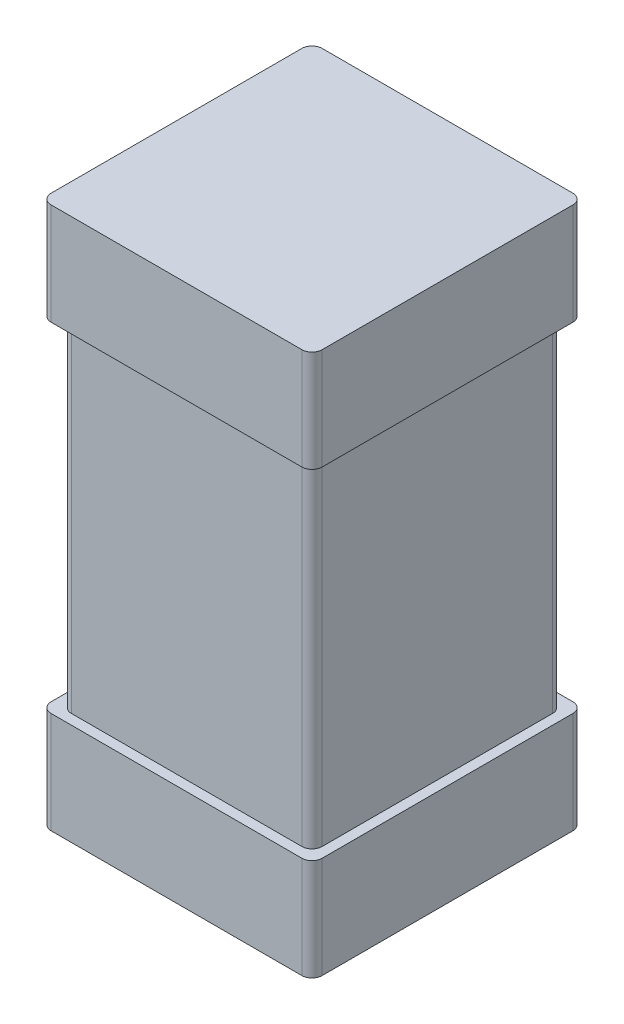
ISO-10303-21;
HEADER;
FILE_DESCRIPTION(('STEP AP214'),'2;1');
FILE_NAME('part.step','',(''),(''),'','','');
FILE_SCHEMA(('AUTOMOTIVE_DESIGN { 1 0 10303 214 1 1 1 1 }'));
ENDSEC;
DATA;
#1=APPLICATION_CONTEXT('core data for automotive mechanical design processes');
#2=APPLICATION_PROTOCOL_DEFINITION('international standard','automotive_design',2000,#1);
#3=PRODUCT_CONTEXT('',#1,'mechanical');
#4=PRODUCT('Part','Part','',(#3));
#5=PRODUCT_RELATED_PRODUCT_CATEGORY('part','',(#4));
#6=PRODUCT_DEFINITION_FORMATION('','',#4);
#7=PRODUCT_DEFINITION_CONTEXT('part definition',#1,'design');
#8=PRODUCT_DEFINITION('design','',#6,#7);
#9=PRODUCT_DEFINITION_SHAPE('','',#8);
#10=(LENGTH_UNIT() NAMED_UNIT(*) SI_UNIT(.MILLI.,.METRE.));
#11=(NAMED_UNIT(*) PLANE_ANGLE_UNIT() SI_UNIT($,.RADIAN.));
#12=(NAMED_UNIT(*) SI_UNIT($,.STERADIAN.) SOLID_ANGLE_UNIT());
#13=UNCERTAINTY_MEASURE_WITH_UNIT(LENGTH_MEASURE(1.E-05),#10,'distance_accuracy_value','');
#14=(GEOMETRIC_REPRESENTATION_CONTEXT(3) GLOBAL_UNCERTAINTY_ASSIGNED_CONTEXT((#13)) GLOBAL_UNIT_ASSIGNED_CONTEXT((#10,
#11,#12)) REPRESENTATION_CONTEXT('',''));
#15=CARTESIAN_POINT('',(0.,0.,0.));
#16=DIRECTION('',(0.,0.,1.));
#17=DIRECTION('',(1.,0.,0.));
#18=AXIS2_PLACEMENT_3D('',#15,#16,#17);
#19=CARTESIAN_POINT('',(129.672744279938,102.69204329235,142.211582908599));
#20=DIRECTION('',(0.,1.,0.));
#21=DIRECTION('',(1.,0.,0.));
#22=AXIS2_PLACEMENT_3D('',#19,#20,#21);
#23=PLANE('',#22);
#24=DIRECTION('',(0.,0.,1.));
#25=VECTOR('',#24,1.);
#26=CARTESIAN_POINT('',(129.672744279938,102.69204329235,142.211582908599));
#27=LINE('',#26,#25);
#28=CARTESIAN_POINT('',(129.672744279938,102.69204329235,142.241582908599));
#29=VERTEX_POINT('',#28);
#30=CARTESIAN_POINT('',(129.672744279938,102.69204329235,142.981582908599));
#31=VERTEX_POINT('',#30);
#32=EDGE_CURVE('E67',#29,#31,#27,.T.);
#33=ORIENTED_EDGE('',*,*,#32,.F.);
#34=CARTESIAN_POINT('',(129.642744279938,102.69204329235,142.241582908599));
#35=DIRECTION('',(0.,1.,0.));
#36=DIRECTION('',(0.,0.,1.));
#37=AXIS2_PLACEMENT_3D('',#34,#35,#36);
#38=CIRCLE('',#37,0.0300000000000023);
#39=CARTESIAN_POINT('',(129.642744279938,102.69204329235,142.211582908599));
#40=VERTEX_POINT('',#39);
#41=EDGE_CURVE('E11',#29,#40,#38,.T.);
#42=ORIENTED_EDGE('',*,*,#41,.T.);
#43=DIRECTION('',(-1.,0.,0.));
#44=VECTOR('',#43,1.);
#45=CARTESIAN_POINT('',(129.672744279938,102.69204329235,142.211582908599));
#46=LINE('',#45,#44);
#47=CARTESIAN_POINT('',(128.902744279938,102.69204329235,142.211582908599));
#48=VERTEX_POINT('',#47);
#49=EDGE_CURVE('E55',#40,#48,#46,.T.);
#50=ORIENTED_EDGE('',*,*,#49,.T.);
#51=CARTESIAN_POINT('',(128.902744279938,102.69204329235,142.241582908599));
#52=DIRECTION('',(0.,-1.,0.));
#53=DIRECTION('',(0.,0.,1.));
#54=AXIS2_PLACEMENT_3D('',#51,#52,#53);
#55=CIRCLE('',#54,0.0300000000000023);
#56=CARTESIAN_POINT('',(128.872744279938,102.69204329235,142.241582908599));
#57=VERTEX_POINT('',#56);
#58=EDGE_CURVE('E471',#57,#48,#55,.T.);
#59=ORIENTED_EDGE('',*,*,#58,.F.);
#60=DIRECTION('',(0.,0.,1.));
#61=VECTOR('',#60,1.);
#62=CARTESIAN_POINT('',(128.872744279938,102.69204329235,142.211582908599));
#63=LINE('',#62,#61);
#64=CARTESIAN_POINT('',(128.872744279938,102.69204329235,142.981582908599));
#65=VERTEX_POINT('',#64);
#66=EDGE_CURVE('E337',#57,#65,#63,.T.);
#67=ORIENTED_EDGE('',*,*,#66,.T.);
#68=CARTESIAN_POINT('',(128.902744279938,102.69204329235,142.981582908599));
#69=DIRECTION('',(0.,1.,0.));
#70=DIRECTION('',(0.,0.,1.));
#71=AXIS2_PLACEMENT_3D('',#68,#69,#70);
#72=CIRCLE('',#71,0.0300000000000023);
#73=CARTESIAN_POINT('',(128.902744279938,102.69204329235,143.011582908599));
#74=VERTEX_POINT('',#73);
#75=EDGE_CURVE('E509',#65,#74,#72,.T.);
#76=ORIENTED_EDGE('',*,*,#75,.T.);
#77=DIRECTION('',(-1.,0.,0.));
#78=VECTOR('',#77,1.);
#79=CARTESIAN_POINT('',(129.672744279938,102.69204329235,143.011582908599));
#80=LINE('',#79,#78);
#81=CARTESIAN_POINT('',(129.642744279938,102.69204329235,143.011582908599));
#82=VERTEX_POINT('',#81);
#83=EDGE_CURVE('E332',#82,#74,#80,.T.);
#84=ORIENTED_EDGE('',*,*,#83,.F.);
#85=CARTESIAN_POINT('',(129.642744279938,102.69204329235,142.981582908599));
#86=DIRECTION('',(0.,-1.,0.));
#87=DIRECTION('',(0.,0.,1.));
#88=AXIS2_PLACEMENT_3D('',#85,#86,#87);
#89=CIRCLE('',#88,0.0300000000000023);
#90=EDGE_CURVE('E422',#31,#82,#89,.T.);
#91=ORIENTED_EDGE('',*,*,#90,.F.);
#92=EDGE_LOOP('',(#33,#42,#50,#59,#67,#76,#84,#91));
#93=FACE_BOUND('',#92,.T.);
#94=ADVANCED_FACE('F44',(#93),#23,.T.);
#95=CARTESIAN_POINT('',(128.872744279938,102.39204329235,142.211582908599));
#96=DIRECTION('',(-1.,0.,0.));
#97=DIRECTION('',(0.,0.,1.));
#98=AXIS2_PLACEMENT_3D('',#95,#96,#97);
#99=PLANE('',#98);
#100=ORIENTED_EDGE('',*,*,#66,.F.);
#101=DIRECTION('',(0.,1.,0.));
#102=VECTOR('',#101,1.);
#103=CARTESIAN_POINT('',(128.872744279938,102.39204329235,142.241582908599));
#104=LINE('',#103,#102);
#105=CARTESIAN_POINT('',(128.872744279938,102.39204329235,142.241582908599));
#106=VERTEX_POINT('',#105);
#107=EDGE_CURVE('E466',#106,#57,#104,.T.);
#108=ORIENTED_EDGE('',*,*,#107,.F.);
#109=DIRECTION('',(0.,0.,1.));
#110=VECTOR('',#109,1.);
#111=CARTESIAN_POINT('',(128.872744279938,102.39204329235,142.211582908599));
#112=LINE('',#111,#110);
#113=CARTESIAN_POINT('',(128.872744279938,102.39204329235,142.981582908599));
#114=VERTEX_POINT('',#113);
#115=EDGE_CURVE('E449',#106,#114,#112,.T.);
#116=ORIENTED_EDGE('',*,*,#115,.T.);
#117=DIRECTION('',(0.,1.,0.));
#118=VECTOR('',#117,1.);
#119=CARTESIAN_POINT('',(128.872744279938,102.39204329235,142.981582908599));
#120=LINE('',#119,#118);
#121=EDGE_CURVE('E445',#114,#65,#120,.T.);
#122=ORIENTED_EDGE('',*,*,#121,.T.);
#123=EDGE_LOOP('',(#100,#108,#116,#122));
#124=FACE_BOUND('',#123,.T.);
#125=ADVANCED_FACE('F590',(#124),#99,.T.);
#126=CARTESIAN_POINT('',(128.902744279938,102.39204329235,142.981582908599));
#127=DIRECTION('',(0.,1.,0.));
#128=DIRECTION('',(-1.,0.,0.));
#129=AXIS2_PLACEMENT_3D('',#126,#127,#128);
#130=CYLINDRICAL_SURFACE('',#129,0.0300000000000023);
#131=CARTESIAN_POINT('',(128.902744279938,102.39204329235,142.981582908599));
#132=DIRECTION('',(0.,1.,0.));
#133=DIRECTION('',(0.,0.,1.));
#134=AXIS2_PLACEMENT_3D('',#131,#132,#133);
#135=CIRCLE('',#134,0.0300000000000023);
#136=CARTESIAN_POINT('',(128.902744279938,102.39204329235,143.011582908599));
#137=VERTEX_POINT('',#136);
#138=EDGE_CURVE('E375',#114,#137,#135,.T.);
#139=ORIENTED_EDGE('',*,*,#138,.T.);
#140=DIRECTION('',(0.,1.,0.));
#141=VECTOR('',#140,1.);
#142=CARTESIAN_POINT('',(128.902744279938,102.39204329235,143.011582908599));
#143=LINE('',#142,#141);
#144=EDGE_CURVE('E470',#137,#74,#143,.T.);
#145=ORIENTED_EDGE('',*,*,#144,.T.);
#146=ORIENTED_EDGE('',*,*,#75,.F.);
#147=ORIENTED_EDGE('',*,*,#121,.F.);
#148=EDGE_LOOP('',(#139,#145,#146,#147));
#149=FACE_BOUND('',#148,.T.);
#150=ADVANCED_FACE('F595',(#149),#130,.T.);
#151=CARTESIAN_POINT('',(128.902744279938,102.39204329235,142.241582908599));
#152=DIRECTION('',(0.,1.,0.));
#153=DIRECTION('',(-1.,0.,0.));
#154=AXIS2_PLACEMENT_3D('',#151,#152,#153);
#155=CYLINDRICAL_SURFACE('',#154,0.0300000000000023);
#156=ORIENTED_EDGE('',*,*,#107,.T.);
#157=ORIENTED_EDGE('',*,*,#58,.T.);
#158=DIRECTION('',(0.,1.,0.));
#159=VECTOR('',#158,1.);
#160=CARTESIAN_POINT('',(128.902744279938,102.39204329235,142.211582908599));
#161=LINE('',#160,#159);
#162=CARTESIAN_POINT('',(128.902744279938,102.39204329235,142.211582908599));
#163=VERTEX_POINT('',#162);
#164=EDGE_CURVE('E328',#163,#48,#161,.T.);
#165=ORIENTED_EDGE('',*,*,#164,.F.);
#166=CARTESIAN_POINT('',(128.902744279938,102.39204329235,142.241582908599));
#167=DIRECTION('',(0.,-1.,0.));
#168=DIRECTION('',(0.,0.,1.));
#169=AXIS2_PLACEMENT_3D('',#166,#167,#168);
#170=CIRCLE('',#169,0.0300000000000023);
#171=EDGE_CURVE('E458',#106,#163,#170,.T.);
#172=ORIENTED_EDGE('',*,*,#171,.F.);
#173=EDGE_LOOP('',(#156,#157,#165,#172));
#174=FACE_BOUND('',#173,.T.);
#175=ADVANCED_FACE('F603',(#174),#155,.T.);
#176=CARTESIAN_POINT('',(129.672744279938,102.39204329235,143.011582908599));
#177=DIRECTION('',(0.,0.,1.));
#178=DIRECTION('',(1.,0.,0.));
#179=AXIS2_PLACEMENT_3D('',#176,#177,#178);
#180=PLANE('',#179);
#181=DIRECTION('',(-1.,0.,0.));
#182=VECTOR('',#181,1.);
#183=CARTESIAN_POINT('',(129.672744279938,102.39204329235,143.011582908599));
#184=LINE('',#183,#182);
#185=CARTESIAN_POINT('',(129.642744279938,102.39204329235,143.011582908599));
#186=VERTEX_POINT('',#185);
#187=EDGE_CURVE('E454',#186,#137,#184,.T.);
#188=ORIENTED_EDGE('',*,*,#187,.F.);
#189=DIRECTION('',(0.,1.,0.));
#190=VECTOR('',#189,1.);
#191=CARTESIAN_POINT('',(129.642744279938,102.39204329235,143.011582908599));
#192=LINE('',#191,#190);
#193=EDGE_CURVE('E443',#186,#82,#192,.T.);
#194=ORIENTED_EDGE('',*,*,#193,.T.);
#195=ORIENTED_EDGE('',*,*,#83,.T.);
#196=ORIENTED_EDGE('',*,*,#144,.F.);
#197=EDGE_LOOP('',(#188,#194,#195,#196));
#198=FACE_BOUND('',#197,.T.);
#199=ADVANCED_FACE('F605',(#198),#180,.T.);
#200=CARTESIAN_POINT('',(129.672744279938,102.39204329235,142.211582908599));
#201=DIRECTION('',(0.,0.,1.));
#202=DIRECTION('',(1.,0.,0.));
#203=AXIS2_PLACEMENT_3D('',#200,#201,#202);
#204=PLANE('',#203);
#205=ORIENTED_EDGE('',*,*,#164,.T.);
#206=ORIENTED_EDGE('',*,*,#49,.F.);
#207=DIRECTION('',(0.,1.,0.));
#208=VECTOR('',#207,1.);
#209=CARTESIAN_POINT('',(129.642744279938,102.39204329235,142.211582908599));
#210=LINE('',#209,#208);
#211=CARTESIAN_POINT('',(129.642744279938,102.39204329235,142.211582908599));
#212=VERTEX_POINT('',#211);
#213=EDGE_CURVE('E234',#212,#40,#210,.T.);
#214=ORIENTED_EDGE('',*,*,#213,.F.);
#215=DIRECTION('',(-1.,0.,0.));
#216=VECTOR('',#215,1.);
#217=CARTESIAN_POINT('',(129.672744279938,102.39204329235,142.211582908599));
#218=LINE('',#217,#216);
#219=EDGE_CURVE('E333',#212,#163,#218,.T.);
#220=ORIENTED_EDGE('',*,*,#219,.T.);
#221=EDGE_LOOP('',(#205,#206,#214,#220));
#222=FACE_BOUND('',#221,.T.);
#223=ADVANCED_FACE('F610',(#222),#204,.F.);
#224=CARTESIAN_POINT('',(129.642744279938,102.39204329235,142.981582908599));
#225=DIRECTION('',(0.,1.,0.));
#226=DIRECTION('',(1.,0.,0.));
#227=AXIS2_PLACEMENT_3D('',#224,#225,#226);
#228=CYLINDRICAL_SURFACE('',#227,0.0300000000000023);
#229=DIRECTION('',(0.,1.,0.));
#230=VECTOR('',#229,1.);
#231=CARTESIAN_POINT('',(129.672744279938,102.39204329235,142.981582908599));
#232=LINE('',#231,#230);
#233=CARTESIAN_POINT('',(129.672744279938,102.39204329235,142.981582908599));
#234=VERTEX_POINT('',#233);
#235=EDGE_CURVE('E419',#234,#31,#232,.T.);
#236=ORIENTED_EDGE('',*,*,#235,.T.);
#237=ORIENTED_EDGE('',*,*,#90,.T.);
#238=ORIENTED_EDGE('',*,*,#193,.F.);
#239=CARTESIAN_POINT('',(129.642744279938,102.39204329235,142.981582908599));
#240=DIRECTION('',(0.,-1.,0.));
#241=DIRECTION('',(0.,0.,1.));
#242=AXIS2_PLACEMENT_3D('',#239,#240,#241);
#243=CIRCLE('',#242,0.0300000000000023);
#244=EDGE_CURVE('E246',#234,#186,#243,.T.);
#245=ORIENTED_EDGE('',*,*,#244,.F.);
#246=EDGE_LOOP('',(#236,#237,#238,#245));
#247=FACE_BOUND('',#246,.T.);
#248=ADVANCED_FACE('F663',(#247),#228,.T.);
#249=CARTESIAN_POINT('',(129.642744279938,102.39204329235,142.241582908599));
#250=DIRECTION('',(0.,1.,0.));
#251=DIRECTION('',(1.,0.,0.));
#252=AXIS2_PLACEMENT_3D('',#249,#250,#251);
#253=CYLINDRICAL_SURFACE('',#252,0.0300000000000023);
#254=CARTESIAN_POINT('',(129.642744279938,102.39204329235,142.241582908599));
#255=DIRECTION('',(0.,1.,0.));
#256=DIRECTION('',(0.,0.,1.));
#257=AXIS2_PLACEMENT_3D('',#254,#255,#256);
#258=CIRCLE('',#257,0.0300000000000023);
#259=CARTESIAN_POINT('',(129.672744279938,102.39204329235,142.241582908599));
#260=VERTEX_POINT('',#259);
#261=EDGE_CURVE('E413',#260,#212,#258,.T.);
#262=ORIENTED_EDGE('',*,*,#261,.T.);
#263=ORIENTED_EDGE('',*,*,#213,.T.);
#264=ORIENTED_EDGE('',*,*,#41,.F.);
#265=DIRECTION('',(0.,1.,0.));
#266=VECTOR('',#265,1.);
#267=CARTESIAN_POINT('',(129.672744279938,102.39204329235,142.241582908599));
#268=LINE('',#267,#266);
#269=EDGE_CURVE('E414',#260,#29,#268,.T.);
#270=ORIENTED_EDGE('',*,*,#269,.F.);
#271=EDGE_LOOP('',(#262,#263,#264,#270));
#272=FACE_BOUND('',#271,.T.);
#273=ADVANCED_FACE('F660',(#272),#253,.T.);
#274=CARTESIAN_POINT('',(129.672744279938,102.39204329235,142.211582908599));
#275=DIRECTION('',(-1.,0.,0.));
#276=DIRECTION('',(0.,0.,1.));
#277=AXIS2_PLACEMENT_3D('',#274,#275,#276);
#278=PLANE('',#277);
#279=ORIENTED_EDGE('',*,*,#235,.F.);
#280=DIRECTION('',(0.,0.,1.));
#281=VECTOR('',#280,1.);
#282=CARTESIAN_POINT('',(129.672744279938,102.39204329235,142.211582908599));
#283=LINE('',#282,#281);
#284=EDGE_CURVE('E390',#260,#234,#283,.T.);
#285=ORIENTED_EDGE('',*,*,#284,.F.);
#286=ORIENTED_EDGE('',*,*,#269,.T.);
#287=ORIENTED_EDGE('',*,*,#32,.T.);
#288=EDGE_LOOP('',(#279,#285,#286,#287));
#289=FACE_BOUND('',#288,.T.);
#290=ADVANCED_FACE('F658',(#289),#278,.F.);
#291=CARTESIAN_POINT('',(129.672744279938,102.39204329235,142.211582908599));
#292=DIRECTION('',(0.,1.,0.));
#293=DIRECTION('',(1.,0.,0.));
#294=AXIS2_PLACEMENT_3D('',#291,#292,#293);
#295=PLANE('',#294);
#296=ORIENTED_EDGE('',*,*,#244,.T.);
#297=ORIENTED_EDGE('',*,*,#187,.T.);
#298=ORIENTED_EDGE('',*,*,#138,.F.);
#299=ORIENTED_EDGE('',*,*,#115,.F.);
#300=ORIENTED_EDGE('',*,*,#171,.T.);
#301=ORIENTED_EDGE('',*,*,#219,.F.);
#302=ORIENTED_EDGE('',*,*,#261,.F.);
#303=ORIENTED_EDGE('',*,*,#284,.T.);
#304=EDGE_LOOP('',(#296,#297,#298,#299,#300,#301,#302,#303));
#305=FACE_BOUND('',#304,.T.);
#306=DIRECTION('',(-1.,0.,0.));
#307=VECTOR('',#306,1.);
#308=CARTESIAN_POINT('',(129.642744279938,102.39204329235,142.241582908599));
#309=LINE('',#308,#307);
#310=CARTESIAN_POINT('',(129.612744279938,102.39204329235,142.241582908599));
#311=VERTEX_POINT('',#310);
#312=CARTESIAN_POINT('',(128.932744279938,102.39204329235,142.241582908599));
#313=VERTEX_POINT('',#312);
#314=EDGE_CURVE('E301',#311,#313,#309,.T.);
#315=ORIENTED_EDGE('',*,*,#314,.T.);
#316=CARTESIAN_POINT('',(128.932744279938,102.39204329235,142.271582908599));
#317=DIRECTION('',(0.,-1.,0.));
#318=DIRECTION('',(0.,0.,1.));
#319=AXIS2_PLACEMENT_3D('',#316,#317,#318);
#320=CIRCLE('',#319,0.0300000000000023);
#321=CARTESIAN_POINT('',(128.902744279938,102.39204329235,142.271582908599));
#322=VERTEX_POINT('',#321);
#323=EDGE_CURVE('E297',#322,#313,#320,.T.);
#324=ORIENTED_EDGE('',*,*,#323,.F.);
#325=DIRECTION('',(0.,0.,1.));
#326=VECTOR('',#325,1.);
#327=CARTESIAN_POINT('',(128.902744279938,102.39204329235,142.241582908599));
#328=LINE('',#327,#326);
#329=CARTESIAN_POINT('',(128.902744279938,102.39204329235,142.951582908599));
#330=VERTEX_POINT('',#329);
#331=EDGE_CURVE('E293',#322,#330,#328,.T.);
#332=ORIENTED_EDGE('',*,*,#331,.T.);
#333=CARTESIAN_POINT('',(128.932744279938,102.39204329235,142.951582908599));
#334=DIRECTION('',(0.,1.,0.));
#335=DIRECTION('',(0.,0.,1.));
#336=AXIS2_PLACEMENT_3D('',#333,#334,#335);
#337=CIRCLE('',#336,0.0300000000000023);
#338=CARTESIAN_POINT('',(128.932744279938,102.39204329235,142.981582908599));
#339=VERTEX_POINT('',#338);
#340=EDGE_CURVE('E48',#330,#339,#337,.T.);
#341=ORIENTED_EDGE('',*,*,#340,.T.);
#342=DIRECTION('',(-1.,0.,0.));
#343=VECTOR('',#342,1.);
#344=CARTESIAN_POINT('',(129.642744279938,102.39204329235,142.981582908599));
#345=LINE('',#344,#343);
#346=CARTESIAN_POINT('',(129.612744279938,102.39204329235,142.981582908599));
#347=VERTEX_POINT('',#346);
#348=EDGE_CURVE('E434',#347,#339,#345,.T.);
#349=ORIENTED_EDGE('',*,*,#348,.F.);
#350=CARTESIAN_POINT('',(129.612744279938,102.39204329235,142.951582908599));
#351=DIRECTION('',(0.,-1.,0.));
#352=DIRECTION('',(0.,0.,1.));
#353=AXIS2_PLACEMENT_3D('',#350,#351,#352);
#354=CIRCLE('',#353,0.0300000000000023);
#355=CARTESIAN_POINT('',(129.642744279938,102.39204329235,142.951582908599));
#356=VERTEX_POINT('',#355);
#357=EDGE_CURVE('E433',#356,#347,#354,.T.);
#358=ORIENTED_EDGE('',*,*,#357,.F.);
#359=DIRECTION('',(0.,0.,1.));
#360=VECTOR('',#359,1.);
#361=CARTESIAN_POINT('',(129.642744279938,102.39204329235,142.241582908599));
#362=LINE('',#361,#360);
#363=CARTESIAN_POINT('',(129.642744279938,102.39204329235,142.271582908599));
#364=VERTEX_POINT('',#363);
#365=EDGE_CURVE('E338',#364,#356,#362,.T.);
#366=ORIENTED_EDGE('',*,*,#365,.F.);
#367=CARTESIAN_POINT('',(129.612744279938,102.39204329235,142.271582908599));
#368=DIRECTION('',(0.,1.,0.));
#369=DIRECTION('',(0.,0.,1.));
#370=AXIS2_PLACEMENT_3D('',#367,#368,#369);
#371=CIRCLE('',#370,0.0300000000000023);
#372=EDGE_CURVE('E294',#364,#311,#371,.T.);
#373=ORIENTED_EDGE('',*,*,#372,.T.);
#374=EDGE_LOOP('',(#315,#324,#332,#341,#349,#358,#366,#373));
#375=FACE_BOUND('',#374,.T.);
#376=ADVANCED_FACE('F46',(#305,#375),#295,.F.);
#377=CARTESIAN_POINT('',(129.642744279938,101.39204329235,142.241582908599));
#378=DIRECTION('',(-1.,0.,0.));
#379=DIRECTION('',(0.,0.,1.));
#380=AXIS2_PLACEMENT_3D('',#377,#378,#379);
#381=PLANE('',#380);
#382=DIRECTION('',(0.,1.,0.));
#383=VECTOR('',#382,1.);
#384=CARTESIAN_POINT('',(129.642744279938,101.39204329235,142.951582908599));
#385=LINE('',#384,#383);
#386=CARTESIAN_POINT('',(129.642744279938,101.39204329235,142.951582908599));
#387=VERTEX_POINT('',#386);
#388=EDGE_CURVE('E342',#387,#356,#385,.T.);
#389=ORIENTED_EDGE('',*,*,#388,.F.);
#390=DIRECTION('',(0.,0.,1.));
#391=VECTOR('',#390,1.);
#392=CARTESIAN_POINT('',(129.642744279938,101.39204329235,142.241582908599));
#393=LINE('',#392,#391);
#394=CARTESIAN_POINT('',(129.642744279938,101.39204329235,142.271582908599));
#395=VERTEX_POINT('',#394);
#396=EDGE_CURVE('E400',#395,#387,#393,.T.);
#397=ORIENTED_EDGE('',*,*,#396,.F.);
#398=DIRECTION('',(0.,1.,0.));
#399=VECTOR('',#398,1.);
#400=CARTESIAN_POINT('',(129.642744279938,101.39204329235,142.271582908599));
#401=LINE('',#400,#399);
#402=EDGE_CURVE('E319',#395,#364,#401,.T.);
#403=ORIENTED_EDGE('',*,*,#402,.T.);
#404=ORIENTED_EDGE('',*,*,#365,.T.);
#405=EDGE_LOOP('',(#389,#397,#403,#404));
#406=FACE_BOUND('',#405,.T.);
#407=ADVANCED_FACE('F564',(#406),#381,.F.);
#408=CARTESIAN_POINT('',(129.612744279938,101.39204329235,142.951582908599));
#409=DIRECTION('',(0.,1.,0.));
#410=DIRECTION('',(1.,0.,0.));
#411=AXIS2_PLACEMENT_3D('',#408,#409,#410);
#412=CYLINDRICAL_SURFACE('',#411,0.0300000000000023);
#413=ORIENTED_EDGE('',*,*,#388,.T.);
#414=ORIENTED_EDGE('',*,*,#357,.T.);
#415=DIRECTION('',(0.,1.,0.));
#416=VECTOR('',#415,1.);
#417=CARTESIAN_POINT('',(129.612744279938,101.39204329235,142.981582908599));
#418=LINE('',#417,#416);
#419=CARTESIAN_POINT('',(129.612744279938,101.39204329235,142.981582908599));
#420=VERTEX_POINT('',#419);
#421=EDGE_CURVE('E429',#420,#347,#418,.T.);
#422=ORIENTED_EDGE('',*,*,#421,.F.);
#423=CARTESIAN_POINT('',(129.612744279938,101.39204329235,142.951582908599));
#424=DIRECTION('',(0.,-1.,0.));
#425=DIRECTION('',(0.,0.,1.));
#426=AXIS2_PLACEMENT_3D('',#423,#424,#425);
#427=CIRCLE('',#426,0.0300000000000023);
#428=EDGE_CURVE('E359',#387,#420,#427,.T.);
#429=ORIENTED_EDGE('',*,*,#428,.F.);
#430=EDGE_LOOP('',(#413,#414,#422,#429));
#431=FACE_BOUND('',#430,.T.);
#432=ADVANCED_FACE('F572',(#431),#412,.T.);
#433=CARTESIAN_POINT('',(129.642744279938,101.39204329235,142.981582908599));
#434=DIRECTION('',(0.,0.,1.));
#435=DIRECTION('',(1.,0.,0.));
#436=AXIS2_PLACEMENT_3D('',#433,#434,#435);
#437=PLANE('',#436);
#438=DIRECTION('',(-1.,0.,0.));
#439=VECTOR('',#438,1.);
#440=CARTESIAN_POINT('',(129.642744279938,101.39204329235,142.981582908599));
#441=LINE('',#440,#439);
#442=CARTESIAN_POINT('',(128.932744279938,101.39204329235,142.981582908599));
#443=VERTEX_POINT('',#442);
#444=EDGE_CURVE('E351',#420,#443,#441,.T.);
#445=ORIENTED_EDGE('',*,*,#444,.F.);
#446=ORIENTED_EDGE('',*,*,#421,.T.);
#447=ORIENTED_EDGE('',*,*,#348,.T.);
#448=DIRECTION('',(0.,1.,0.));
#449=VECTOR('',#448,1.);
#450=CARTESIAN_POINT('',(128.932744279938,101.39204329235,142.981582908599));
#451=LINE('',#450,#449);
#452=EDGE_CURVE('E289',#443,#339,#451,.T.);
#453=ORIENTED_EDGE('',*,*,#452,.F.);
#454=EDGE_LOOP('',(#445,#446,#447,#453));
#455=FACE_BOUND('',#454,.T.);
#456=ADVANCED_FACE('F575',(#455),#437,.T.);
#457=CARTESIAN_POINT('',(128.932744279938,101.39204329235,142.951582908599));
#458=DIRECTION('',(0.,1.,0.));
#459=DIRECTION('',(-1.,0.,0.));
#460=AXIS2_PLACEMENT_3D('',#457,#458,#459);
#461=CYLINDRICAL_SURFACE('',#460,0.0300000000000023);
#462=CARTESIAN_POINT('',(128.932744279938,101.39204329235,142.951582908599));
#463=DIRECTION('',(0.,1.,0.));
#464=DIRECTION('',(0.,0.,1.));
#465=AXIS2_PLACEMENT_3D('',#462,#463,#464);
#466=CIRCLE('',#465,0.0300000000000023);
#467=CARTESIAN_POINT('',(128.902744279938,101.39204329235,142.951582908599));
#468=VERTEX_POINT('',#467);
#469=EDGE_CURVE('E398',#468,#443,#466,.T.);
#470=ORIENTED_EDGE('',*,*,#469,.T.);
#471=ORIENTED_EDGE('',*,*,#452,.T.);
#472=ORIENTED_EDGE('',*,*,#340,.F.);
#473=DIRECTION('',(0.,1.,0.));
#474=VECTOR('',#473,1.);
#475=CARTESIAN_POINT('',(128.902744279938,101.39204329235,142.951582908599));
#476=LINE('',#475,#474);
#477=EDGE_CURVE('E286',#468,#330,#476,.T.);
#478=ORIENTED_EDGE('',*,*,#477,.F.);
#479=EDGE_LOOP('',(#470,#471,#472,#478));
#480=FACE_BOUND('',#479,.T.);
#481=ADVANCED_FACE('F284',(#480),#461,.T.);
#482=CARTESIAN_POINT('',(128.902744279938,101.39204329235,142.241582908599));
#483=DIRECTION('',(-1.,0.,0.));
#484=DIRECTION('',(0.,0.,1.));
#485=AXIS2_PLACEMENT_3D('',#482,#483,#484);
#486=PLANE('',#485);
#487=ORIENTED_EDGE('',*,*,#331,.F.);
#488=DIRECTION('',(0.,1.,0.));
#489=VECTOR('',#488,1.);
#490=CARTESIAN_POINT('',(128.902744279938,101.39204329235,142.271582908599));
#491=LINE('',#490,#489);
#492=CARTESIAN_POINT('',(128.902744279938,101.39204329235,142.271582908599));
#493=VERTEX_POINT('',#492);
#494=EDGE_CURVE('E308',#493,#322,#491,.T.);
#495=ORIENTED_EDGE('',*,*,#494,.F.);
#496=DIRECTION('',(0.,0.,1.));
#497=VECTOR('',#496,1.);
#498=CARTESIAN_POINT('',(128.902744279938,101.39204329235,142.241582908599));
#499=LINE('',#498,#497);
#500=EDGE_CURVE('E306',#493,#468,#499,.T.);
#501=ORIENTED_EDGE('',*,*,#500,.T.);
#502=ORIENTED_EDGE('',*,*,#477,.T.);
#503=EDGE_LOOP('',(#487,#495,#501,#502));
#504=FACE_BOUND('',#503,.T.);
#505=ADVANCED_FACE('F304',(#504),#486,.T.);
#506=CARTESIAN_POINT('',(128.932744279938,101.39204329235,142.271582908599));
#507=DIRECTION('',(0.,1.,0.));
#508=DIRECTION('',(-1.,0.,0.));
#509=AXIS2_PLACEMENT_3D('',#506,#507,#508);
#510=CYLINDRICAL_SURFACE('',#509,0.0300000000000023);
#511=ORIENTED_EDGE('',*,*,#494,.T.);
#512=ORIENTED_EDGE('',*,*,#323,.T.);
#513=DIRECTION('',(0.,1.,0.));
#514=VECTOR('',#513,1.);
#515=CARTESIAN_POINT('',(128.932744279938,101.39204329235,142.241582908599));
#516=LINE('',#515,#514);
#517=CARTESIAN_POINT('',(128.932744279938,101.39204329235,142.241582908599));
#518=VERTEX_POINT('',#517);
#519=EDGE_CURVE('E327',#518,#313,#516,.T.);
#520=ORIENTED_EDGE('',*,*,#519,.F.);
#521=CARTESIAN_POINT('',(128.932744279938,101.39204329235,142.271582908599));
#522=DIRECTION('',(0.,-1.,0.));
#523=DIRECTION('',(0.,0.,1.));
#524=AXIS2_PLACEMENT_3D('',#521,#522,#523);
#525=CIRCLE('',#524,0.0300000000000023);
#526=EDGE_CURVE('E348',#493,#518,#525,.T.);
#527=ORIENTED_EDGE('',*,*,#526,.F.);
#528=EDGE_LOOP('',(#511,#512,#520,#527));
#529=FACE_BOUND('',#528,.T.);
#530=ADVANCED_FACE('F577',(#529),#510,.T.);
#531=CARTESIAN_POINT('',(129.642744279938,101.39204329235,142.241582908599));
#532=DIRECTION('',(0.,0.,1.));
#533=DIRECTION('',(1.,0.,0.));
#534=AXIS2_PLACEMENT_3D('',#531,#532,#533);
#535=PLANE('',#534);
#536=ORIENTED_EDGE('',*,*,#519,.T.);
#537=ORIENTED_EDGE('',*,*,#314,.F.);
#538=DIRECTION('',(0.,1.,0.));
#539=VECTOR('',#538,1.);
#540=CARTESIAN_POINT('',(129.612744279938,101.39204329235,142.241582908599));
#541=LINE('',#540,#539);
#542=CARTESIAN_POINT('',(129.612744279938,101.39204329235,142.241582908599));
#543=VERTEX_POINT('',#542);
#544=EDGE_CURVE('E438',#543,#311,#541,.T.);
#545=ORIENTED_EDGE('',*,*,#544,.F.);
#546=DIRECTION('',(-1.,0.,0.));
#547=VECTOR('',#546,1.);
#548=CARTESIAN_POINT('',(129.642744279938,101.39204329235,142.241582908599));
#549=LINE('',#548,#547);
#550=EDGE_CURVE('E525',#543,#518,#549,.T.);
#551=ORIENTED_EDGE('',*,*,#550,.T.);
#552=EDGE_LOOP('',(#536,#537,#545,#551));
#553=FACE_BOUND('',#552,.T.);
#554=ADVANCED_FACE('F579',(#553),#535,.F.);
#555=CARTESIAN_POINT('',(129.612744279938,101.39204329235,142.271582908599));
#556=DIRECTION('',(0.,1.,0.));
#557=DIRECTION('',(1.,0.,0.));
#558=AXIS2_PLACEMENT_3D('',#555,#556,#557);
#559=CYLINDRICAL_SURFACE('',#558,0.0300000000000023);
#560=CARTESIAN_POINT('',(129.612744279938,101.39204329235,142.271582908599));
#561=DIRECTION('',(0.,1.,0.));
#562=DIRECTION('',(0.,0.,1.));
#563=AXIS2_PLACEMENT_3D('',#560,#561,#562);
#564=CIRCLE('',#563,0.0300000000000023);
#565=EDGE_CURVE('E491',#395,#543,#564,.T.);
#566=ORIENTED_EDGE('',*,*,#565,.T.);
#567=ORIENTED_EDGE('',*,*,#544,.T.);
#568=ORIENTED_EDGE('',*,*,#372,.F.);
#569=ORIENTED_EDGE('',*,*,#402,.F.);
#570=EDGE_LOOP('',(#566,#567,#568,#569));
#571=FACE_BOUND('',#570,.T.);
#572=ADVANCED_FACE('F567',(#571),#559,.T.);
#573=CARTESIAN_POINT('',(129.672744279938,101.39204329235,142.211582908599));
#574=DIRECTION('',(0.,1.,0.));
#575=DIRECTION('',(1.,0.,0.));
#576=AXIS2_PLACEMENT_3D('',#573,#574,#575);
#577=PLANE('',#576);
#578=DIRECTION('',(0.,0.,1.));
#579=VECTOR('',#578,1.);
#580=CARTESIAN_POINT('',(129.672744279938,101.39204329235,142.211582908599));
#581=LINE('',#580,#579);
#582=CARTESIAN_POINT('',(129.672744279938,101.39204329235,142.241582908599));
#583=VERTEX_POINT('',#582);
#584=CARTESIAN_POINT('',(129.672744279938,101.39204329235,142.981582908599));
#585=VERTEX_POINT('',#584);
#586=EDGE_CURVE('E264',#583,#585,#581,.T.);
#587=ORIENTED_EDGE('',*,*,#586,.F.);
#588=CARTESIAN_POINT('',(129.642744279938,101.39204329235,142.241582908599));
#589=DIRECTION('',(0.,1.,0.));
#590=DIRECTION('',(0.,0.,1.));
#591=AXIS2_PLACEMENT_3D('',#588,#589,#590);
#592=CIRCLE('',#591,0.0300000000000023);
#593=CARTESIAN_POINT('',(129.642744279938,101.39204329235,142.211582908599));
#594=VERTEX_POINT('',#593);
#595=EDGE_CURVE('E435',#583,#594,#592,.T.);
#596=ORIENTED_EDGE('',*,*,#595,.T.);
#597=DIRECTION('',(-1.,0.,0.));
#598=VECTOR('',#597,1.);
#599=CARTESIAN_POINT('',(129.672744279938,101.39204329235,142.211582908599));
#600=LINE('',#599,#598);
#601=CARTESIAN_POINT('',(128.902744279938,101.39204329235,142.211582908599));
#602=VERTEX_POINT('',#601);
#603=EDGE_CURVE('E255',#594,#602,#600,.T.);
#604=ORIENTED_EDGE('',*,*,#603,.T.);
#605=CARTESIAN_POINT('',(128.902744279938,101.39204329235,142.241582908599));
#606=DIRECTION('',(0.,-1.,0.));
#607=DIRECTION('',(0.,0.,1.));
#608=AXIS2_PLACEMENT_3D('',#605,#606,#607);
#609=CIRCLE('',#608,0.0300000000000023);
#610=CARTESIAN_POINT('',(128.872744279938,101.39204329235,142.241582908599));
#611=VERTEX_POINT('',#610);
#612=EDGE_CURVE('E386',#611,#602,#609,.T.);
#613=ORIENTED_EDGE('',*,*,#612,.F.);
#614=DIRECTION('',(0.,0.,1.));
#615=VECTOR('',#614,1.);
#616=CARTESIAN_POINT('',(128.872744279938,101.39204329235,142.211582908599));
#617=LINE('',#616,#615);
#618=CARTESIAN_POINT('',(128.872744279938,101.39204329235,142.981582908599));
#619=VERTEX_POINT('',#618);
#620=EDGE_CURVE('E415',#611,#619,#617,.T.);
#621=ORIENTED_EDGE('',*,*,#620,.T.);
#622=CARTESIAN_POINT('',(128.902744279938,101.39204329235,142.981582908599));
#623=DIRECTION('',(0.,1.,0.));
#624=DIRECTION('',(0.,0.,1.));
#625=AXIS2_PLACEMENT_3D('',#622,#623,#624);
#626=CIRCLE('',#625,0.0300000000000023);
#627=CARTESIAN_POINT('',(128.902744279938,101.39204329235,143.011582908599));
#628=VERTEX_POINT('',#627);
#629=EDGE_CURVE('E403',#619,#628,#626,.T.);
#630=ORIENTED_EDGE('',*,*,#629,.T.);
#631=DIRECTION('',(-1.,0.,0.));
#632=VECTOR('',#631,1.);
#633=CARTESIAN_POINT('',(129.672744279938,101.39204329235,143.011582908599));
#634=LINE('',#633,#632);
#635=CARTESIAN_POINT('',(129.642744279938,101.39204329235,143.011582908599));
#636=VERTEX_POINT('',#635);
#637=EDGE_CURVE('E173',#636,#628,#634,.T.);
#638=ORIENTED_EDGE('',*,*,#637,.F.);
#639=CARTESIAN_POINT('',(129.642744279938,101.39204329235,142.981582908599));
#640=DIRECTION('',(0.,-1.,0.));
#641=DIRECTION('',(0.,0.,1.));
#642=AXIS2_PLACEMENT_3D('',#639,#640,#641);
#643=CIRCLE('',#642,0.0300000000000023);
#644=EDGE_CURVE('E185',#585,#636,#643,.T.);
#645=ORIENTED_EDGE('',*,*,#644,.F.);
#646=EDGE_LOOP('',(#587,#596,#604,#613,#621,#630,#638,#645));
#647=FACE_BOUND('',#646,.T.);
#648=ORIENTED_EDGE('',*,*,#565,.F.);
#649=ORIENTED_EDGE('',*,*,#396,.T.);
#650=ORIENTED_EDGE('',*,*,#428,.T.);
#651=ORIENTED_EDGE('',*,*,#444,.T.);
#652=ORIENTED_EDGE('',*,*,#469,.F.);
#653=ORIENTED_EDGE('',*,*,#500,.F.);
#654=ORIENTED_EDGE('',*,*,#526,.T.);
#655=ORIENTED_EDGE('',*,*,#550,.F.);
#656=EDGE_LOOP('',(#648,#649,#650,#651,#652,#653,#654,#655));
#657=FACE_BOUND('',#656,.T.);
#658=ADVANCED_FACE('F568',(#647,#657),#577,.T.);
#659=CARTESIAN_POINT('',(128.872744279938,101.09204329235,142.211582908599));
#660=DIRECTION('',(-1.,0.,0.));
#661=DIRECTION('',(0.,0.,1.));
#662=AXIS2_PLACEMENT_3D('',#659,#660,#661);
#663=PLANE('',#662);
#664=ORIENTED_EDGE('',*,*,#620,.F.);
#665=DIRECTION('',(0.,1.,0.));
#666=VECTOR('',#665,1.);
#667=CARTESIAN_POINT('',(128.872744279938,101.09204329235,142.241582908599));
#668=LINE('',#667,#666);
#669=CARTESIAN_POINT('',(128.872744279938,101.09204329235,142.241582908599));
#670=VERTEX_POINT('',#669);
#671=EDGE_CURVE('E382',#670,#611,#668,.T.);
#672=ORIENTED_EDGE('',*,*,#671,.F.);
#673=DIRECTION('',(0.,0.,1.));
#674=VECTOR('',#673,1.);
#675=CARTESIAN_POINT('',(128.872744279938,101.09204329235,142.211582908599));
#676=LINE('',#675,#674);
#677=CARTESIAN_POINT('',(128.872744279938,101.09204329235,142.981582908599));
#678=VERTEX_POINT('',#677);
#679=EDGE_CURVE('E352',#670,#678,#676,.T.);
#680=ORIENTED_EDGE('',*,*,#679,.T.);
#681=DIRECTION('',(0.,1.,0.));
#682=VECTOR('',#681,1.);
#683=CARTESIAN_POINT('',(128.872744279938,101.09204329235,142.981582908599));
#684=LINE('',#683,#682);
#685=EDGE_CURVE('E363',#678,#619,#684,.T.);
#686=ORIENTED_EDGE('',*,*,#685,.T.);
#687=EDGE_LOOP('',(#664,#672,#680,#686));
#688=FACE_BOUND('',#687,.T.);
#689=ADVANCED_FACE('F602',(#688),#663,.T.);
#690=CARTESIAN_POINT('',(128.902744279938,101.09204329235,142.981582908599));
#691=DIRECTION('',(0.,1.,0.));
#692=DIRECTION('',(-1.,0.,0.));
#693=AXIS2_PLACEMENT_3D('',#690,#691,#692);
#694=CYLINDRICAL_SURFACE('',#693,0.0300000000000023);
#695=CARTESIAN_POINT('',(128.902744279938,101.09204329235,142.981582908599));
#696=DIRECTION('',(0.,1.,0.));
#697=DIRECTION('',(0.,0.,1.));
#698=AXIS2_PLACEMENT_3D('',#695,#696,#697);
#699=CIRCLE('',#698,0.0300000000000023);
#700=CARTESIAN_POINT('',(128.902744279938,101.09204329235,143.011582908599));
#701=VERTEX_POINT('',#700);
#702=EDGE_CURVE('E372',#678,#701,#699,.T.);
#703=ORIENTED_EDGE('',*,*,#702,.T.);
#704=DIRECTION('',(0.,1.,0.));
#705=VECTOR('',#704,1.);
#706=CARTESIAN_POINT('',(128.902744279938,101.09204329235,143.011582908599));
#707=LINE('',#706,#705);
#708=EDGE_CURVE('E385',#701,#628,#707,.T.);
#709=ORIENTED_EDGE('',*,*,#708,.T.);
#710=ORIENTED_EDGE('',*,*,#629,.F.);
#711=ORIENTED_EDGE('',*,*,#685,.F.);
#712=EDGE_LOOP('',(#703,#709,#710,#711));
#713=FACE_BOUND('',#712,.T.);
#714=ADVANCED_FACE('F643',(#713),#694,.T.);
#715=CARTESIAN_POINT('',(128.902744279938,101.09204329235,142.241582908599));
#716=DIRECTION('',(0.,1.,0.));
#717=DIRECTION('',(-1.,0.,0.));
#718=AXIS2_PLACEMENT_3D('',#715,#716,#717);
#719=CYLINDRICAL_SURFACE('',#718,0.0300000000000023);
#720=ORIENTED_EDGE('',*,*,#671,.T.);
#721=ORIENTED_EDGE('',*,*,#612,.T.);
#722=DIRECTION('',(0.,1.,0.));
#723=VECTOR('',#722,1.);
#724=CARTESIAN_POINT('',(128.902744279938,101.09204329235,142.211582908599));
#725=LINE('',#724,#723);
#726=CARTESIAN_POINT('',(128.902744279938,101.09204329235,142.211582908599));
#727=VERTEX_POINT('',#726);
#728=EDGE_CURVE('E381',#727,#602,#725,.T.);
#729=ORIENTED_EDGE('',*,*,#728,.F.);
#730=CARTESIAN_POINT('',(128.902744279938,101.09204329235,142.241582908599));
#731=DIRECTION('',(0.,-1.,0.));
#732=DIRECTION('',(0.,0.,1.));
#733=AXIS2_PLACEMENT_3D('',#730,#731,#732);
#734=CIRCLE('',#733,0.0300000000000023);
#735=EDGE_CURVE('E321',#670,#727,#734,.T.);
#736=ORIENTED_EDGE('',*,*,#735,.F.);
#737=EDGE_LOOP('',(#720,#721,#729,#736));
#738=FACE_BOUND('',#737,.T.);
#739=ADVANCED_FACE('F646',(#738),#719,.T.);
#740=CARTESIAN_POINT('',(129.672744279938,101.09204329235,143.011582908599));
#741=DIRECTION('',(0.,0.,1.));
#742=DIRECTION('',(1.,0.,0.));
#743=AXIS2_PLACEMENT_3D('',#740,#741,#742);
#744=PLANE('',#743);
#745=DIRECTION('',(-1.,0.,0.));
#746=VECTOR('',#745,1.);
#747=CARTESIAN_POINT('',(129.672744279938,101.09204329235,143.011582908599));
#748=LINE('',#747,#746);
#749=CARTESIAN_POINT('',(129.642744279938,101.09204329235,143.011582908599));
#750=VERTEX_POINT('',#749);
#751=EDGE_CURVE('E323',#750,#701,#748,.T.);
#752=ORIENTED_EDGE('',*,*,#751,.F.);
#753=DIRECTION('',(0.,1.,0.));
#754=VECTOR('',#753,1.);
#755=CARTESIAN_POINT('',(129.642744279938,101.09204329235,143.011582908599));
#756=LINE('',#755,#754);
#757=EDGE_CURVE('E380',#750,#636,#756,.T.);
#758=ORIENTED_EDGE('',*,*,#757,.T.);
#759=ORIENTED_EDGE('',*,*,#637,.T.);
#760=ORIENTED_EDGE('',*,*,#708,.F.);
#761=EDGE_LOOP('',(#752,#758,#759,#760));
#762=FACE_BOUND('',#761,.T.);
#763=ADVANCED_FACE('F632',(#762),#744,.T.);
#764=CARTESIAN_POINT('',(129.672744279938,101.09204329235,142.211582908599));
#765=DIRECTION('',(0.,0.,1.));
#766=DIRECTION('',(1.,0.,0.));
#767=AXIS2_PLACEMENT_3D('',#764,#765,#766);
#768=PLANE('',#767);
#769=ORIENTED_EDGE('',*,*,#728,.T.);
#770=ORIENTED_EDGE('',*,*,#603,.F.);
#771=DIRECTION('',(0.,1.,0.));
#772=VECTOR('',#771,1.);
#773=CARTESIAN_POINT('',(129.642744279938,101.09204329235,142.211582908599));
#774=LINE('',#773,#772);
#775=CARTESIAN_POINT('',(129.642744279938,101.09204329235,142.211582908599));
#776=VERTEX_POINT('',#775);
#777=EDGE_CURVE('E343',#776,#594,#774,.T.);
#778=ORIENTED_EDGE('',*,*,#777,.F.);
#779=DIRECTION('',(-1.,0.,0.));
#780=VECTOR('',#779,1.);
#781=CARTESIAN_POINT('',(129.672744279938,101.09204329235,142.211582908599));
#782=LINE('',#781,#780);
#783=EDGE_CURVE('E410',#776,#727,#782,.T.);
#784=ORIENTED_EDGE('',*,*,#783,.T.);
#785=EDGE_LOOP('',(#769,#770,#778,#784));
#786=FACE_BOUND('',#785,.T.);
#787=ADVANCED_FACE('F650',(#786),#768,.F.);
#788=CARTESIAN_POINT('',(129.642744279938,101.09204329235,142.981582908599));
#789=DIRECTION('',(0.,1.,0.));
#790=DIRECTION('',(1.,0.,0.));
#791=AXIS2_PLACEMENT_3D('',#788,#789,#790);
#792=CYLINDRICAL_SURFACE('',#791,0.0300000000000023);
#793=DIRECTION('',(0.,1.,0.));
#794=VECTOR('',#793,1.);
#795=CARTESIAN_POINT('',(129.672744279938,101.09204329235,142.981582908599));
#796=LINE('',#795,#794);
#797=CARTESIAN_POINT('',(129.672744279938,101.09204329235,142.981582908599));
#798=VERTEX_POINT('',#797);
#799=EDGE_CURVE('E407',#798,#585,#796,.T.);
#800=ORIENTED_EDGE('',*,*,#799,.T.);
#801=ORIENTED_EDGE('',*,*,#644,.T.);
#802=ORIENTED_EDGE('',*,*,#757,.F.);
#803=CARTESIAN_POINT('',(129.642744279938,101.09204329235,142.981582908599));
#804=DIRECTION('',(0.,-1.,0.));
#805=DIRECTION('',(0.,0.,1.));
#806=AXIS2_PLACEMENT_3D('',#803,#804,#805);
#807=CIRCLE('',#806,0.0300000000000023);
#808=EDGE_CURVE('E472',#798,#750,#807,.T.);
#809=ORIENTED_EDGE('',*,*,#808,.F.);
#810=EDGE_LOOP('',(#800,#801,#802,#809));
#811=FACE_BOUND('',#810,.T.);
#812=ADVANCED_FACE('F634',(#811),#792,.T.);
#813=CARTESIAN_POINT('',(129.642744279938,101.09204329235,142.241582908599));
#814=DIRECTION('',(0.,1.,0.));
#815=DIRECTION('',(1.,0.,0.));
#816=AXIS2_PLACEMENT_3D('',#813,#814,#815);
#817=CYLINDRICAL_SURFACE('',#816,0.0300000000000023);
#818=CARTESIAN_POINT('',(129.642744279938,101.09204329235,142.241582908599));
#819=DIRECTION('',(0.,1.,0.));
#820=DIRECTION('',(0.,0.,1.));
#821=AXIS2_PLACEMENT_3D('',#818,#819,#820);
#822=CIRCLE('',#821,0.0300000000000023);
#823=CARTESIAN_POINT('',(129.672744279938,101.09204329235,142.241582908599));
#824=VERTEX_POINT('',#823);
#825=EDGE_CURVE('E346',#824,#776,#822,.T.);
#826=ORIENTED_EDGE('',*,*,#825,.T.);
#827=ORIENTED_EDGE('',*,*,#777,.T.);
#828=ORIENTED_EDGE('',*,*,#595,.F.);
#829=DIRECTION('',(0.,1.,0.));
#830=VECTOR('',#829,1.);
#831=CARTESIAN_POINT('',(129.672744279938,101.09204329235,142.241582908599));
#832=LINE('',#831,#830);
#833=EDGE_CURVE('E347',#824,#583,#832,.T.);
#834=ORIENTED_EDGE('',*,*,#833,.F.);
#835=EDGE_LOOP('',(#826,#827,#828,#834));
#836=FACE_BOUND('',#835,.T.);
#837=ADVANCED_FACE('F649',(#836),#817,.T.);
#838=CARTESIAN_POINT('',(129.672744279938,101.09204329235,142.211582908599));
#839=DIRECTION('',(-1.,0.,0.));
#840=DIRECTION('',(0.,0.,1.));
#841=AXIS2_PLACEMENT_3D('',#838,#839,#840);
#842=PLANE('',#841);
#843=ORIENTED_EDGE('',*,*,#799,.F.);
#844=DIRECTION('',(0.,0.,1.));
#845=VECTOR('',#844,1.);
#846=CARTESIAN_POINT('',(129.672744279938,101.09204329235,142.211582908599));
#847=LINE('',#846,#845);
#848=EDGE_CURVE('E324',#824,#798,#847,.T.);
#849=ORIENTED_EDGE('',*,*,#848,.F.);
#850=ORIENTED_EDGE('',*,*,#833,.T.);
#851=ORIENTED_EDGE('',*,*,#586,.T.);
#852=EDGE_LOOP('',(#843,#849,#850,#851));
#853=FACE_BOUND('',#852,.T.);
#854=ADVANCED_FACE('F641',(#853),#842,.F.);
#855=CARTESIAN_POINT('',(129.672744279938,101.09204329235,142.211582908599));
#856=DIRECTION('',(0.,1.,0.));
#857=DIRECTION('',(1.,0.,0.));
#858=AXIS2_PLACEMENT_3D('',#855,#856,#857);
#859=PLANE('',#858);
#860=ORIENTED_EDGE('',*,*,#808,.T.);
#861=ORIENTED_EDGE('',*,*,#751,.T.);
#862=ORIENTED_EDGE('',*,*,#702,.F.);
#863=ORIENTED_EDGE('',*,*,#679,.F.);
#864=ORIENTED_EDGE('',*,*,#735,.T.);
#865=ORIENTED_EDGE('',*,*,#783,.F.);
#866=ORIENTED_EDGE('',*,*,#825,.F.);
#867=ORIENTED_EDGE('',*,*,#848,.T.);
#868=EDGE_LOOP('',(#860,#861,#862,#863,#864,#865,#866,#867));
#869=FACE_BOUND('',#868,.T.);
#870=ADVANCED_FACE('F636',(#869),#859,.F.);
#871=CLOSED_SHELL('',(#94,#125,#150,#175,#199,#223,#248,#273,#290,#376,#407,#432,#456,#481,#505,
#530,#554,#572,#658,#689,#714,#739,#763,#787,#812,#837,#854,#870));
#872=MANIFOLD_SOLID_BREP('B2',#871);
#873=ADVANCED_BREP_SHAPE_REPRESENTATION('',(#18,#872),#14);
#874=SHAPE_DEFINITION_REPRESENTATION(#9,#873);
ENDSEC;
END-ISO-10303-21;
